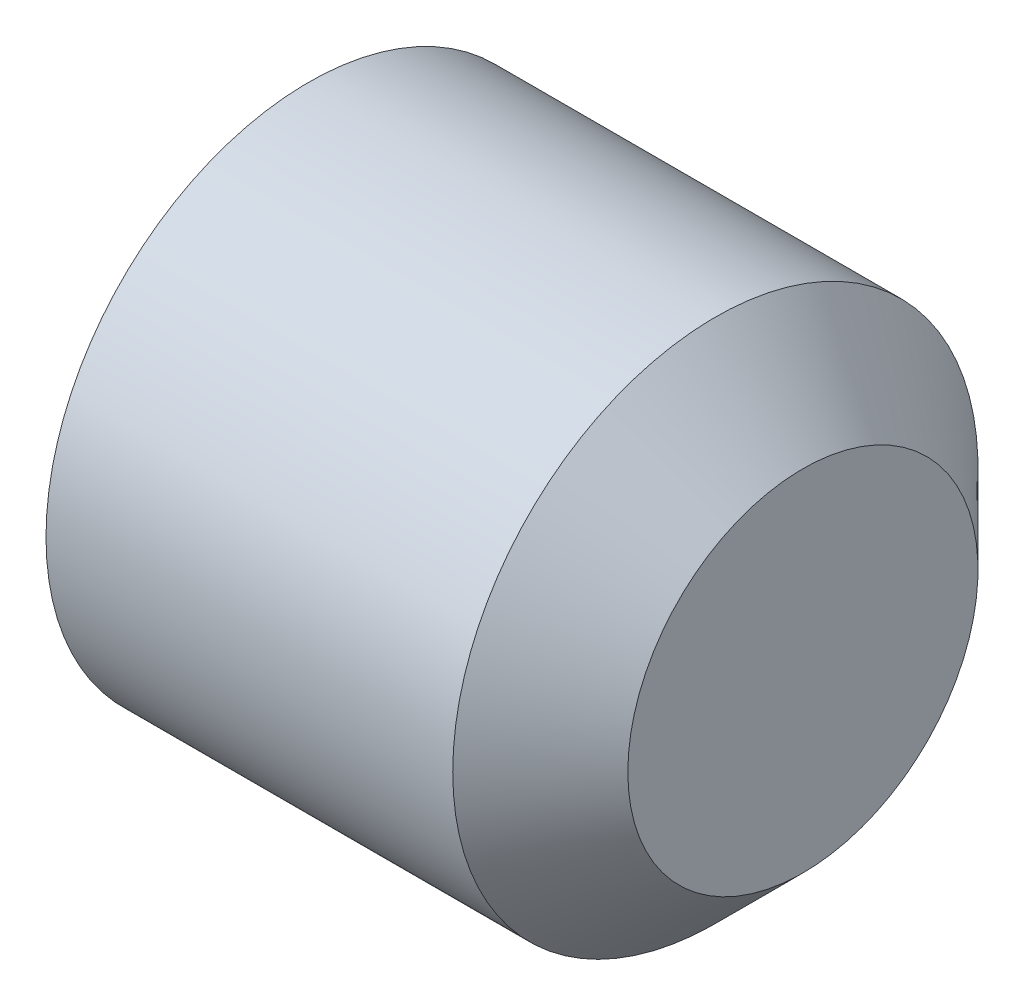
ISO-10303-21;
HEADER;
FILE_DESCRIPTION(('STEP AP214'),'2;1');
FILE_NAME('part.step','',(''),(''),'','','');
FILE_SCHEMA(('AUTOMOTIVE_DESIGN { 1 0 10303 214 1 1 1 1 }'));
ENDSEC;
DATA;
#1=APPLICATION_CONTEXT('core data for automotive mechanical design processes');
#2=APPLICATION_PROTOCOL_DEFINITION('international standard','automotive_design',2000,#1);
#3=PRODUCT_CONTEXT('',#1,'mechanical');
#4=PRODUCT('Part','Part','',(#3));
#5=PRODUCT_RELATED_PRODUCT_CATEGORY('part','',(#4));
#6=PRODUCT_DEFINITION_FORMATION('','',#4);
#7=PRODUCT_DEFINITION_CONTEXT('part definition',#1,'design');
#8=PRODUCT_DEFINITION('design','',#6,#7);
#9=PRODUCT_DEFINITION_SHAPE('','',#8);
#10=(LENGTH_UNIT() NAMED_UNIT(*) SI_UNIT(.MILLI.,.METRE.));
#11=(NAMED_UNIT(*) PLANE_ANGLE_UNIT() SI_UNIT($,.RADIAN.));
#12=(NAMED_UNIT(*) SI_UNIT($,.STERADIAN.) SOLID_ANGLE_UNIT());
#13=UNCERTAINTY_MEASURE_WITH_UNIT(LENGTH_MEASURE(1.E-05),#10,'distance_accuracy_value','');
#14=(GEOMETRIC_REPRESENTATION_CONTEXT(3) GLOBAL_UNCERTAINTY_ASSIGNED_CONTEXT((#13)) GLOBAL_UNIT_ASSIGNED_CONTEXT((#10,
#11,#12)) REPRESENTATION_CONTEXT('',''));
#15=CARTESIAN_POINT('',(0.,0.,0.));
#16=DIRECTION('',(0.,0.,1.));
#17=DIRECTION('',(1.,0.,0.));
#18=AXIS2_PLACEMENT_3D('',#15,#16,#17);
#19=CARTESIAN_POINT('',(0.5,0.,0.));
#20=DIRECTION('',(-1.,0.,0.));
#21=DIRECTION('',(0.,0.,1.));
#22=AXIS2_PLACEMENT_3D('',#19,#20,#21);
#23=CONICAL_SURFACE('',#22,0.,1.0471975511966);
#24=CARTESIAN_POINT('',(0.,0.,0.));
#25=DIRECTION('',(-1.,0.,0.));
#26=DIRECTION('',(0.,0.,1.));
#27=AXIS2_PLACEMENT_3D('',#24,#25,#26);
#28=CIRCLE('',#27,0.86602540378444);
#29=CARTESIAN_POINT('',(0.,0.,0.86602540378444));
#30=VERTEX_POINT('',#29);
#31=CARTESIAN_POINT('',(0.,0.75,0.433012701892222));
#32=VERTEX_POINT('',#31);
#33=EDGE_CURVE('E139',#30,#32,#28,.T.);
#34=ORIENTED_EDGE('',*,*,#33,.T.);
#35=CARTESIAN_POINT('',(-6.66799982216073E-05,0.7502,0.432897231838382));
#36=CARTESIAN_POINT('',(0.0109279672545947,0.717238666576005,0.451927466563575));
#37=CARTESIAN_POINT('',(0.0209278588304373,0.68399281869625,0.471121965786389));
#38=CARTESIAN_POINT('',(0.0383842880739241,0.616925218141244,0.509843463020724));
#39=CARTESIAN_POINT('',(0.0458346476710157,0.583102272153654,0.529371149991445));
#40=CARTESIAN_POINT('',(0.0574342962607427,0.515875632570363,0.568184468451572));
#41=CARTESIAN_POINT('',(0.0616607517951379,0.482482293499614,0.58746412175321));
#42=CARTESIAN_POINT('',(0.0667098540533308,0.415538173911306,0.626114327218181));
#43=CARTESIAN_POINT('',(0.0675366780658327,0.381987637355587,0.645484738530082));
#44=CARTESIAN_POINT('',(0.065833231960248,0.319275698978883,0.681691493033276));
#45=CARTESIAN_POINT('',(0.0637212206264606,0.290104995811374,0.698533206359488));
#46=CARTESIAN_POINT('',(0.0570222121958373,0.231953671848458,0.732106888903211));
#47=CARTESIAN_POINT('',(0.0524329180465317,0.202973252776875,0.748838741655417));
#48=CARTESIAN_POINT('',(0.0409580031195663,0.144701650655193,0.782481866826481));
#49=CARTESIAN_POINT('',(0.0340236523302113,0.115417857581381,0.79938887264054));
#50=CARTESIAN_POINT('',(0.0182846224056367,0.0572874895838318,0.832950456252017));
#51=CARTESIAN_POINT('',(0.00948365081374561,0.0284401676519286,0.849605465334801));
#52=CARTESIAN_POINT('',(-6.66799982221558E-05,-0.000199999999999971,0.866140873838278));
#53=B_SPLINE_CURVE_WITH_KNOTS('',3,(#35,#36,#37,#38,#39,#40,#41,#42,#43,#44,#45,#46,#47,#48,#49,
#50,#51,#52),.UNSPECIFIED.,.F.,.F.,(4,2,2,2,2,2,2,2,4),(0.,0.118896819359341,0.238079744533805,
0.354311719456401,0.470400831872516,0.571553114284106,0.672799351342655,0.776293900714049,
0.87958477934405),.UNSPECIFIED.);
#54=EDGE_CURVE('E11',#32,#30,#53,.T.);
#55=ORIENTED_EDGE('',*,*,#54,.T.);
#56=EDGE_LOOP('',(#34,#55));
#57=FACE_BOUND('',#56,.T.);
#58=ADVANCED_FACE('F40',(#57),#23,.F.);
#59=CARTESIAN_POINT('',(0.,-0.75,0.43301270189222));
#60=VERTEX_POINT('',#59);
#61=EDGE_CURVE('E138',#60,#30,#28,.T.);
#62=ORIENTED_EDGE('',*,*,#61,.T.);
#63=CARTESIAN_POINT('',(-6.66799982221782E-05,0.000200000000000024,0.866140873838278));
#64=CARTESIAN_POINT('',(0.0109279672545941,-0.0327613334239957,0.847110639113085));
#65=CARTESIAN_POINT('',(0.0209278588304367,-0.0660071813037502,0.827916139890271));
#66=CARTESIAN_POINT('',(0.0383842880739237,-0.133074781858756,0.789194642655936));
#67=CARTESIAN_POINT('',(0.0458346476710154,-0.166897727846346,0.769666955685215));
#68=CARTESIAN_POINT('',(0.0574342962607425,-0.234124367429637,0.730853637225088));
#69=CARTESIAN_POINT('',(0.0616607517951377,-0.267517706500387,0.711573983923451));
#70=CARTESIAN_POINT('',(0.0667098540533307,-0.334461826088694,0.672923778458478));
#71=CARTESIAN_POINT('',(0.0675366780658326,-0.368012362644413,0.653553367146578));
#72=CARTESIAN_POINT('',(0.065833231960248,-0.430724301021117,0.617346612643384));
#73=CARTESIAN_POINT('',(0.0637212206264607,-0.459895004188626,0.600504899317172));
#74=CARTESIAN_POINT('',(0.0570222121958375,-0.518046328151543,0.566931216773449));
#75=CARTESIAN_POINT('',(0.052432918046532,-0.547026747223126,0.550199364021243));
#76=CARTESIAN_POINT('',(0.0409580031195668,-0.605298349344807,0.516556238850179));
#77=CARTESIAN_POINT('',(0.0340236523302118,-0.63458214241862,0.49964923303612));
#78=CARTESIAN_POINT('',(0.0182846224056372,-0.692712510416168,0.466087649424643));
#79=CARTESIAN_POINT('',(0.00948365081374614,-0.721559832348072,0.449432640341859));
#80=CARTESIAN_POINT('',(-6.6679998221607E-05,-0.7502,0.432897231838382));
#81=B_SPLINE_CURVE_WITH_KNOTS('',3,(#63,#64,#65,#66,#67,#68,#69,#70,#71,#72,#73,#74,#75,#76,#77,
#78,#79,#80),.UNSPECIFIED.,.F.,.F.,(4,2,2,2,2,2,2,2,4),(0.,0.118896819359341,0.238079744533806,
0.354311719456402,0.470400831872516,0.571553114284106,0.672799351342656,0.776293900714049,
0.87958477934405),.UNSPECIFIED.);
#82=EDGE_CURVE('E54',#30,#60,#81,.T.);
#83=ORIENTED_EDGE('',*,*,#82,.T.);
#84=EDGE_LOOP('',(#62,#83));
#85=FACE_BOUND('',#84,.T.);
#86=ADVANCED_FACE('F214',(#85),#23,.F.);
#87=CARTESIAN_POINT('',(0.,-0.75,-0.43301270189222));
#88=VERTEX_POINT('',#87);
#89=EDGE_CURVE('E242',#88,#60,#28,.T.);
#90=ORIENTED_EDGE('',*,*,#89,.T.);
#91=CARTESIAN_POINT('',(-0.433916243365394,-0.75,1.43321270189222));
#92=CARTESIAN_POINT('',(-0.399618568158197,-0.75,1.36606683502777));
#93=CARTESIAN_POINT('',(-0.365651862584069,-0.75,1.29873887092999));
#94=CARTESIAN_POINT('',(-0.298877307857266,-0.75,1.16336842342566));
#95=CARTESIAN_POINT('',(-0.266071556455107,-0.75,1.09532490870407));
#96=CARTESIAN_POINT('',(-0.200612521876176,-0.75,0.954916510940638));
#97=CARTESIAN_POINT('',(-0.16805207687524,-0.75,0.882508020823048));
#98=CARTESIAN_POINT('',(-0.106139543575523,-0.75,0.736347383880538));
#99=CARTESIAN_POINT('',(-0.0767853575530622,-0.75,0.662596152860419));
#100=CARTESIAN_POINT('',(-0.0344925144918121,-0.75,0.543812755889771));
#101=CARTESIAN_POINT('',(-0.0197633393337374,-0.75,0.499425775516502));
#102=CARTESIAN_POINT('',(0.00704230453915017,-0.75,0.409866081146042));
#103=CARTESIAN_POINT('',(0.0191201726602635,-0.75,0.364693795301044));
#104=CARTESIAN_POINT('',(0.0395325170413964,-0.75,0.274372006403573));
#105=CARTESIAN_POINT('',(0.047932519639834,-0.75,0.229237746527779));
#106=CARTESIAN_POINT('',(0.0604133198374797,-0.75,0.138378132265814));
#107=CARTESIAN_POINT('',(0.0644965476474826,-0.75,0.0926531251449315));
#108=CARTESIAN_POINT('',(0.0678102435593724,-0.75,0.000484998044596922));
#109=CARTESIAN_POINT('',(0.066983601436463,-0.75,-0.0459602805353406));
#110=CARTESIAN_POINT('',(0.0604665934580115,-0.75,-0.138510564072106));
#111=CARTESIAN_POINT('',(0.0547743068507406,-0.75,-0.18461542739672));
#112=CARTESIAN_POINT('',(0.039119149449605,-0.75,-0.276999368453847));
#113=CARTESIAN_POINT('',(0.0290746306437487,-0.75,-0.323264096111191));
#114=CARTESIAN_POINT('',(0.00570473952587702,-0.75,-0.414944949279294));
#115=CARTESIAN_POINT('',(-0.00762138849560119,-0.75,-0.460360876727503));
#116=CARTESIAN_POINT('',(-0.0355013539306271,-0.75,-0.54677574574007));
#117=CARTESIAN_POINT('',(-0.0498696976528041,-0.75,-0.587835684825918));
#118=CARTESIAN_POINT('',(-0.0801207602083334,-0.75,-0.669397508788868));
#119=CARTESIAN_POINT('',(-0.0960037784843394,-0.75,-0.709899281500738));
#120=CARTESIAN_POINT('',(-0.145349092225707,-0.75,-0.830787683189045));
#121=CARTESIAN_POINT('',(-0.180483491990364,-0.75,-0.910487402329192));
#122=CARTESIAN_POINT('',(-0.251355043505842,-0.75,-1.06447961866958));
#123=CARTESIAN_POINT('',(-0.286960570037413,-0.75,-1.13883412573839));
#124=CARTESIAN_POINT('',(-0.341413352748403,-0.75,-1.24972062027204));
#125=CARTESIAN_POINT('',(-0.35971150389094,-0.75,-1.28652316950015));
#126=CARTESIAN_POINT('',(-0.396605902450401,-0.75,-1.35997498768799));
#127=CARTESIAN_POINT('',(-0.415202126066091,-0.75,-1.39662426859449));
#128=CARTESIAN_POINT('',(-0.433916243365394,-0.75,-1.43321270189222));
#129=B_SPLINE_CURVE_WITH_KNOTS('',3,(#91,#92,#93,#94,#95,#96,#97,#98,#99,#100,#101,#102,#103,
#104,#105,#106,#107,#108,#109,#110,#111,#112,#113,#114,#115,#116,#117,#118,#119,#120,#121,#122,
#123,#124,#125,#126,#127,#128),.UNSPECIFIED.,.F.,.F.,(4,2,2,2,2,2,2,2,2,2,2,2,2,2,2,2,2,2,4),
(0.,0.226212170495582,0.452814140544187,0.690955605221207,0.92894031846288,1.06918355725571,
1.20935259427054,1.34691118026573,1.4843922837227,1.62347563632315,1.76261391854908,
1.90448382535697,2.04638643345541,2.17685299489812,2.30734540252851,2.56855197443952,
2.8158551359845,2.9391552371937,3.06244554139839),.UNSPECIFIED.);
#130=EDGE_CURVE('E188',#60,#88,#129,.T.);
#131=ORIENTED_EDGE('',*,*,#130,.T.);
#132=EDGE_LOOP('',(#90,#131));
#133=FACE_BOUND('',#132,.T.);
#134=ADVANCED_FACE('F220',(#133),#23,.F.);
#135=CARTESIAN_POINT('',(0.,0.,-0.86602540378444));
#136=VERTEX_POINT('',#135);
#137=EDGE_CURVE('E240',#136,#88,#28,.T.);
#138=ORIENTED_EDGE('',*,*,#137,.T.);
#139=CARTESIAN_POINT('',(-6.66799982216073E-05,-0.7502,-0.432897231838382));
#140=CARTESIAN_POINT('',(0.0109279672545947,-0.717238666576005,-0.451927466563575));
#141=CARTESIAN_POINT('',(0.0209278588304373,-0.68399281869625,-0.471121965786389));
#142=CARTESIAN_POINT('',(0.0383842880739241,-0.616925218141244,-0.509843463020724));
#143=CARTESIAN_POINT('',(0.0458346476710157,-0.583102272153654,-0.529371149991445));
#144=CARTESIAN_POINT('',(0.0574342962607427,-0.515875632570363,-0.568184468451572));
#145=CARTESIAN_POINT('',(0.0616607517951379,-0.482482293499614,-0.58746412175321));
#146=CARTESIAN_POINT('',(0.0667098540533308,-0.415538173911306,-0.626114327218181));
#147=CARTESIAN_POINT('',(0.0675366780658327,-0.381987637355587,-0.645484738530082));
#148=CARTESIAN_POINT('',(0.065833231960248,-0.319275698978883,-0.681691493033276));
#149=CARTESIAN_POINT('',(0.0637212206264606,-0.290104995811374,-0.698533206359488));
#150=CARTESIAN_POINT('',(0.0570222121958373,-0.231953671848458,-0.732106888903211));
#151=CARTESIAN_POINT('',(0.0524329180465317,-0.202973252776875,-0.748838741655417));
#152=CARTESIAN_POINT('',(0.0409580031195663,-0.144701650655193,-0.782481866826481));
#153=CARTESIAN_POINT('',(0.0340236523302113,-0.115417857581381,-0.79938887264054));
#154=CARTESIAN_POINT('',(0.0182846224056367,-0.0572874895838318,-0.832950456252017));
#155=CARTESIAN_POINT('',(0.00948365081374561,-0.0284401676519286,-0.849605465334801));
#156=CARTESIAN_POINT('',(-6.66799982221558E-05,0.000199999999999971,-0.866140873838278));
#157=B_SPLINE_CURVE_WITH_KNOTS('',3,(#139,#140,#141,#142,#143,#144,#145,#146,#147,#148,#149,
#150,#151,#152,#153,#154,#155,#156),.UNSPECIFIED.,.F.,.F.,(4,2,2,2,2,2,2,2,4),(0.,
0.118896819359341,0.238079744533805,0.354311719456401,0.470400831872516,0.571553114284106,
0.672799351342655,0.776293900714049,0.87958477934405),.UNSPECIFIED.);
#158=EDGE_CURVE('E182',#88,#136,#157,.T.);
#159=ORIENTED_EDGE('',*,*,#158,.T.);
#160=EDGE_LOOP('',(#138,#159));
#161=FACE_BOUND('',#160,.T.);
#162=ADVANCED_FACE('F231',(#161),#23,.F.);
#163=CARTESIAN_POINT('',(0.,0.75,-0.43301270189222));
#164=VERTEX_POINT('',#163);
#165=EDGE_CURVE('E238',#164,#136,#28,.T.);
#166=ORIENTED_EDGE('',*,*,#165,.T.);
#167=CARTESIAN_POINT('',(-6.66799982221782E-05,-0.000200000000000024,-0.866140873838278));
#168=CARTESIAN_POINT('',(0.0109279672545941,0.0327613334239957,-0.847110639113085));
#169=CARTESIAN_POINT('',(0.0209278588304367,0.0660071813037502,-0.827916139890271));
#170=CARTESIAN_POINT('',(0.0383842880739237,0.133074781858756,-0.789194642655936));
#171=CARTESIAN_POINT('',(0.0458346476710154,0.166897727846346,-0.769666955685215));
#172=CARTESIAN_POINT('',(0.0574342962607425,0.234124367429637,-0.730853637225088));
#173=CARTESIAN_POINT('',(0.0616607517951377,0.267517706500387,-0.711573983923451));
#174=CARTESIAN_POINT('',(0.0667098540533307,0.334461826088694,-0.672923778458478));
#175=CARTESIAN_POINT('',(0.0675366780658326,0.368012362644413,-0.653553367146578));
#176=CARTESIAN_POINT('',(0.065833231960248,0.430724301021117,-0.617346612643384));
#177=CARTESIAN_POINT('',(0.0637212206264607,0.459895004188626,-0.600504899317172));
#178=CARTESIAN_POINT('',(0.0570222121958375,0.518046328151543,-0.566931216773449));
#179=CARTESIAN_POINT('',(0.052432918046532,0.547026747223126,-0.550199364021243));
#180=CARTESIAN_POINT('',(0.0409580031195668,0.605298349344807,-0.516556238850179));
#181=CARTESIAN_POINT('',(0.0340236523302118,0.63458214241862,-0.49964923303612));
#182=CARTESIAN_POINT('',(0.0182846224056372,0.692712510416168,-0.466087649424643));
#183=CARTESIAN_POINT('',(0.00948365081374614,0.721559832348072,-0.449432640341859));
#184=CARTESIAN_POINT('',(-6.6679998221607E-05,0.7502,-0.432897231838382));
#185=B_SPLINE_CURVE_WITH_KNOTS('',3,(#167,#168,#169,#170,#171,#172,#173,#174,#175,#176,#177,
#178,#179,#180,#181,#182,#183,#184),.UNSPECIFIED.,.F.,.F.,(4,2,2,2,2,2,2,2,4),(0.,
0.118896819359341,0.238079744533806,0.354311719456402,0.470400831872516,0.571553114284106,
0.672799351342656,0.776293900714049,0.87958477934405),.UNSPECIFIED.);
#186=EDGE_CURVE('E121',#136,#164,#185,.T.);
#187=ORIENTED_EDGE('',*,*,#186,.T.);
#188=EDGE_LOOP('',(#166,#187));
#189=FACE_BOUND('',#188,.T.);
#190=ADVANCED_FACE('F223',(#189),#23,.F.);
#191=EDGE_CURVE('E143',#32,#164,#28,.T.);
#192=ORIENTED_EDGE('',*,*,#191,.T.);
#193=CARTESIAN_POINT('',(-0.433916243365394,0.75,-1.43321270189222));
#194=CARTESIAN_POINT('',(-0.399618568158197,0.75,-1.36606683502777));
#195=CARTESIAN_POINT('',(-0.365651862584069,0.75,-1.29873887092999));
#196=CARTESIAN_POINT('',(-0.298877307857266,0.75,-1.16336842342566));
#197=CARTESIAN_POINT('',(-0.266071556455107,0.75,-1.09532490870407));
#198=CARTESIAN_POINT('',(-0.200612521876176,0.75,-0.954916510940638));
#199=CARTESIAN_POINT('',(-0.16805207687524,0.75,-0.882508020823048));
#200=CARTESIAN_POINT('',(-0.106139543575523,0.75,-0.736347383880538));
#201=CARTESIAN_POINT('',(-0.0767853575530622,0.75,-0.662596152860419));
#202=CARTESIAN_POINT('',(-0.0344925144918121,0.75,-0.543812755889771));
#203=CARTESIAN_POINT('',(-0.0197633393337374,0.75,-0.499425775516502));
#204=CARTESIAN_POINT('',(0.00704230453915017,0.75,-0.409866081146042));
#205=CARTESIAN_POINT('',(0.0191201726602635,0.75,-0.364693795301044));
#206=CARTESIAN_POINT('',(0.0395325170413964,0.75,-0.274372006403573));
#207=CARTESIAN_POINT('',(0.047932519639834,0.75,-0.229237746527779));
#208=CARTESIAN_POINT('',(0.0604133198374797,0.75,-0.138378132265814));
#209=CARTESIAN_POINT('',(0.0644965476474826,0.75,-0.0926531251449315));
#210=CARTESIAN_POINT('',(0.0678102435593724,0.75,-0.000484998044596922));
#211=CARTESIAN_POINT('',(0.066983601436463,0.75,0.0459602805353406));
#212=CARTESIAN_POINT('',(0.0604665934580115,0.75,0.138510564072106));
#213=CARTESIAN_POINT('',(0.0547743068507406,0.75,0.18461542739672));
#214=CARTESIAN_POINT('',(0.039119149449605,0.75,0.276999368453847));
#215=CARTESIAN_POINT('',(0.0290746306437487,0.75,0.323264096111191));
#216=CARTESIAN_POINT('',(0.00570473952587702,0.75,0.414944949279294));
#217=CARTESIAN_POINT('',(-0.00762138849560119,0.75,0.460360876727503));
#218=CARTESIAN_POINT('',(-0.0355013539306271,0.75,0.54677574574007));
#219=CARTESIAN_POINT('',(-0.0498696976528041,0.75,0.587835684825918));
#220=CARTESIAN_POINT('',(-0.0801207602083334,0.75,0.669397508788868));
#221=CARTESIAN_POINT('',(-0.0960037784843394,0.75,0.709899281500738));
#222=CARTESIAN_POINT('',(-0.145349092225707,0.75,0.830787683189045));
#223=CARTESIAN_POINT('',(-0.180483491990364,0.75,0.910487402329192));
#224=CARTESIAN_POINT('',(-0.251355043505842,0.75,1.06447961866958));
#225=CARTESIAN_POINT('',(-0.286960570037413,0.75,1.13883412573839));
#226=CARTESIAN_POINT('',(-0.341413352748403,0.75,1.24972062027204));
#227=CARTESIAN_POINT('',(-0.35971150389094,0.75,1.28652316950015));
#228=CARTESIAN_POINT('',(-0.396605902450401,0.75,1.35997498768799));
#229=CARTESIAN_POINT('',(-0.415202126066091,0.75,1.39662426859449));
#230=CARTESIAN_POINT('',(-0.433916243365394,0.75,1.43321270189222));
#231=B_SPLINE_CURVE_WITH_KNOTS('',3,(#193,#194,#195,#196,#197,#198,#199,#200,#201,#202,#203,
#204,#205,#206,#207,#208,#209,#210,#211,#212,#213,#214,#215,#216,#217,#218,#219,#220,#221,#222,
#223,#224,#225,#226,#227,#228,#229,#230),.UNSPECIFIED.,.F.,.F.,(4,2,2,2,2,2,2,2,2,2,2,2,2,2,2,2,
2,2,4),(0.,0.226212170495582,0.452814140544187,0.690955605221207,0.92894031846288,
1.06918355725571,1.20935259427054,1.34691118026573,1.4843922837227,1.62347563632315,
1.76261391854908,1.90448382535697,2.04638643345541,2.17685299489812,2.30734540252851,
2.56855197443952,2.8158551359845,2.9391552371937,3.06244554139839),.UNSPECIFIED.);
#232=EDGE_CURVE('E87',#164,#32,#231,.T.);
#233=ORIENTED_EDGE('',*,*,#232,.T.);
#234=EDGE_LOOP('',(#192,#233));
#235=FACE_BOUND('',#234,.T.);
#236=ADVANCED_FACE('F216',(#235),#23,.F.);
#237=CARTESIAN_POINT('',(3.,0.,0.));
#238=DIRECTION('',(1.,0.,0.));
#239=DIRECTION('',(0.,0.,-1.));
#240=AXIS2_PLACEMENT_3D('',#237,#238,#239);
#241=PLANE('',#240);
#242=CARTESIAN_POINT('',(3.,0.,0.));
#243=DIRECTION('',(-1.,0.,0.));
#244=DIRECTION('',(0.,0.,1.));
#245=AXIS2_PLACEMENT_3D('',#242,#243,#244);
#246=CIRCLE('',#245,1.);
#247=CARTESIAN_POINT('',(3.,0.,1.));
#248=VERTEX_POINT('',#247);
#249=EDGE_CURVE('E152',#248,#248,#246,.T.);
#250=ORIENTED_EDGE('',*,*,#249,.F.);
#251=EDGE_LOOP('',(#250));
#252=FACE_BOUND('',#251,.T.);
#253=ADVANCED_FACE('F42',(#252),#241,.T.);
#254=CARTESIAN_POINT('',(2.5,0.,0.));
#255=DIRECTION('',(-1.,0.,0.));
#256=DIRECTION('',(0.,0.,1.));
#257=AXIS2_PLACEMENT_3D('',#254,#255,#256);
#258=CONICAL_SURFACE('',#257,1.5,0.785398163397448);
#259=ORIENTED_EDGE('',*,*,#249,.T.);
#260=EDGE_LOOP('',(#259));
#261=FACE_BOUND('',#260,.T.);
#262=CARTESIAN_POINT('',(2.5,0.,0.));
#263=DIRECTION('',(-1.,0.,0.));
#264=DIRECTION('',(0.,0.,1.));
#265=AXIS2_PLACEMENT_3D('',#262,#263,#264);
#266=CIRCLE('',#265,1.5);
#267=CARTESIAN_POINT('',(2.5,0.,1.5));
#268=VERTEX_POINT('',#267);
#269=EDGE_CURVE('E149',#268,#268,#266,.T.);
#270=ORIENTED_EDGE('',*,*,#269,.F.);
#271=EDGE_LOOP('',(#270));
#272=FACE_BOUND('',#271,.T.);
#273=ADVANCED_FACE('F229',(#261,#272),#258,.T.);
#274=CARTESIAN_POINT('',(0.5,0.,0.));
#275=DIRECTION('',(-1.,0.,0.));
#276=DIRECTION('',(0.,0.,1.));
#277=AXIS2_PLACEMENT_3D('',#274,#275,#276);
#278=CYLINDRICAL_SURFACE('',#277,1.5);
#279=ORIENTED_EDGE('',*,*,#269,.T.);
#280=EDGE_LOOP('',(#279));
#281=FACE_BOUND('',#280,.T.);
#282=CARTESIAN_POINT('',(0.17695785750662,0.,0.));
#283=DIRECTION('',(-1.,0.,0.));
#284=DIRECTION('',(0.,0.,1.));
#285=AXIS2_PLACEMENT_3D('',#282,#283,#284);
#286=CIRCLE('',#285,1.5);
#287=CARTESIAN_POINT('',(0.17695785750662,0.,1.5));
#288=VERTEX_POINT('',#287);
#289=EDGE_CURVE('E146',#288,#288,#286,.T.);
#290=ORIENTED_EDGE('',*,*,#289,.F.);
#291=EDGE_LOOP('',(#290));
#292=FACE_BOUND('',#291,.T.);
#293=ADVANCED_FACE('F280',(#281,#292),#278,.T.);
#294=CARTESIAN_POINT('',(0.,0.,0.));
#295=DIRECTION('',(1.,0.,0.));
#296=DIRECTION('',(0.,0.,-1.));
#297=AXIS2_PLACEMENT_3D('',#294,#295,#296);
#298=CONICAL_SURFACE('',#297,1.1935,1.0471975511966);
#299=ORIENTED_EDGE('',*,*,#289,.T.);
#300=EDGE_LOOP('',(#299));
#301=FACE_BOUND('',#300,.T.);
#302=CARTESIAN_POINT('',(0.,0.,0.));
#303=DIRECTION('',(-1.,0.,0.));
#304=DIRECTION('',(0.,0.,1.));
#305=AXIS2_PLACEMENT_3D('',#302,#303,#304);
#306=CIRCLE('',#305,1.1935);
#307=CARTESIAN_POINT('',(0.,0.,1.1935));
#308=VERTEX_POINT('',#307);
#309=EDGE_CURVE('E142',#308,#308,#306,.T.);
#310=ORIENTED_EDGE('',*,*,#309,.F.);
#311=EDGE_LOOP('',(#310));
#312=FACE_BOUND('',#311,.T.);
#313=ADVANCED_FACE('F211',(#301,#312),#298,.T.);
#314=CARTESIAN_POINT('',(0.,-1.1935,0.));
#315=DIRECTION('',(-1.,0.,0.));
#316=DIRECTION('',(0.,0.,1.));
#317=AXIS2_PLACEMENT_3D('',#314,#315,#316);
#318=PLANE('',#317);
#319=ORIENTED_EDGE('',*,*,#309,.T.);
#320=EDGE_LOOP('',(#319));
#321=FACE_BOUND('',#320,.T.);
#322=ORIENTED_EDGE('',*,*,#33,.F.);
#323=ORIENTED_EDGE('',*,*,#61,.F.);
#324=ORIENTED_EDGE('',*,*,#89,.F.);
#325=ORIENTED_EDGE('',*,*,#137,.F.);
#326=ORIENTED_EDGE('',*,*,#165,.F.);
#327=ORIENTED_EDGE('',*,*,#191,.F.);
#328=EDGE_LOOP('',(#322,#323,#324,#325,#326,#327));
#329=FACE_BOUND('',#328,.T.);
#330=ADVANCED_FACE('F206',(#321,#329),#318,.T.);
#331=CARTESIAN_POINT('',(1.2,0.75,0.43301270189222));
#332=DIRECTION('',(0.,-0.500000000000001,-0.866025403784438));
#333=DIRECTION('',(0.,0.866025403784438,-0.500000000000001));
#334=AXIS2_PLACEMENT_3D('',#331,#332,#333);
#335=PLANE('',#334);
#336=DIRECTION('',(-1.,0.,0.));
#337=VECTOR('',#336,1.);
#338=CARTESIAN_POINT('',(1.2,0.75,0.43301270189222));
#339=LINE('',#338,#337);
#340=CARTESIAN_POINT('',(1.2,0.75,0.43301270189222));
#341=VERTEX_POINT('',#340);
#342=EDGE_CURVE('E61',#341,#32,#339,.T.);
#343=ORIENTED_EDGE('',*,*,#342,.F.);
#344=DIRECTION('',(0.,-0.866025403784438,0.500000000000001));
#345=VECTOR('',#344,1.);
#346=CARTESIAN_POINT('',(1.2,0.75,0.43301270189222));
#347=LINE('',#346,#345);
#348=CARTESIAN_POINT('',(1.2,0.,0.86602540378444));
#349=VERTEX_POINT('',#348);
#350=EDGE_CURVE('E251',#341,#349,#347,.T.);
#351=ORIENTED_EDGE('',*,*,#350,.T.);
#352=DIRECTION('',(-1.,0.,0.));
#353=VECTOR('',#352,1.);
#354=CARTESIAN_POINT('',(1.2,0.,0.86602540378444));
#355=LINE('',#354,#353);
#356=EDGE_CURVE('E135',#349,#30,#355,.T.);
#357=ORIENTED_EDGE('',*,*,#356,.T.);
#358=ORIENTED_EDGE('',*,*,#54,.F.);
#359=EDGE_LOOP('',(#343,#351,#357,#358));
#360=FACE_BOUND('',#359,.T.);
#361=ADVANCED_FACE('F202',(#360),#335,.T.);
#362=CARTESIAN_POINT('',(1.2,0.,0.86602540378444));
#363=DIRECTION('',(0.,0.500000000000001,-0.866025403784438));
#364=DIRECTION('',(0.,0.866025403784438,0.500000000000001));
#365=AXIS2_PLACEMENT_3D('',#362,#363,#364);
#366=PLANE('',#365);
#367=ORIENTED_EDGE('',*,*,#356,.F.);
#368=DIRECTION('',(0.,-0.866025403784438,-0.500000000000001));
#369=VECTOR('',#368,1.);
#370=CARTESIAN_POINT('',(1.2,0.,0.86602540378444));
#371=LINE('',#370,#369);
#372=CARTESIAN_POINT('',(1.2,-0.75,0.43301270189222));
#373=VERTEX_POINT('',#372);
#374=EDGE_CURVE('E96',#349,#373,#371,.T.);
#375=ORIENTED_EDGE('',*,*,#374,.T.);
#376=DIRECTION('',(-1.,0.,0.));
#377=VECTOR('',#376,1.);
#378=CARTESIAN_POINT('',(1.2,-0.75,0.43301270189222));
#379=LINE('',#378,#377);
#380=EDGE_CURVE('E132',#373,#60,#379,.T.);
#381=ORIENTED_EDGE('',*,*,#380,.T.);
#382=ORIENTED_EDGE('',*,*,#82,.F.);
#383=EDGE_LOOP('',(#367,#375,#381,#382));
#384=FACE_BOUND('',#383,.T.);
#385=ADVANCED_FACE('F199',(#384),#366,.T.);
#386=CARTESIAN_POINT('',(1.2,-0.75,0.43301270189222));
#387=DIRECTION('',(0.,1.,0.));
#388=DIRECTION('',(0.,0.,1.));
#389=AXIS2_PLACEMENT_3D('',#386,#387,#388);
#390=PLANE('',#389);
#391=ORIENTED_EDGE('',*,*,#380,.F.);
#392=DIRECTION('',(0.,0.,-1.));
#393=VECTOR('',#392,1.);
#394=CARTESIAN_POINT('',(1.2,-0.75,0.43301270189222));
#395=LINE('',#394,#393);
#396=CARTESIAN_POINT('',(1.2,-0.75,-0.43301270189222));
#397=VERTEX_POINT('',#396);
#398=EDGE_CURVE('E116',#373,#397,#395,.T.);
#399=ORIENTED_EDGE('',*,*,#398,.T.);
#400=DIRECTION('',(-1.,0.,0.));
#401=VECTOR('',#400,1.);
#402=CARTESIAN_POINT('',(1.2,-0.75,-0.43301270189222));
#403=LINE('',#402,#401);
#404=EDGE_CURVE('E113',#397,#88,#403,.T.);
#405=ORIENTED_EDGE('',*,*,#404,.T.);
#406=ORIENTED_EDGE('',*,*,#130,.F.);
#407=EDGE_LOOP('',(#391,#399,#405,#406));
#408=FACE_BOUND('',#407,.T.);
#409=ADVANCED_FACE('F179',(#408),#390,.T.);
#410=CARTESIAN_POINT('',(1.2,-0.75,-0.43301270189222));
#411=DIRECTION('',(0.,0.500000000000001,0.866025403784438));
#412=DIRECTION('',(0.,-0.866025403784438,0.500000000000001));
#413=AXIS2_PLACEMENT_3D('',#410,#411,#412);
#414=PLANE('',#413);
#415=ORIENTED_EDGE('',*,*,#404,.F.);
#416=DIRECTION('',(0.,0.866025403784438,-0.500000000000001));
#417=VECTOR('',#416,1.);
#418=CARTESIAN_POINT('',(1.2,-0.75,-0.43301270189222));
#419=LINE('',#418,#417);
#420=CARTESIAN_POINT('',(1.2,0.,-0.86602540378444));
#421=VERTEX_POINT('',#420);
#422=EDGE_CURVE('E107',#397,#421,#419,.T.);
#423=ORIENTED_EDGE('',*,*,#422,.T.);
#424=DIRECTION('',(-1.,0.,0.));
#425=VECTOR('',#424,1.);
#426=CARTESIAN_POINT('',(1.2,0.,-0.86602540378444));
#427=LINE('',#426,#425);
#428=EDGE_CURVE('E110',#421,#136,#427,.T.);
#429=ORIENTED_EDGE('',*,*,#428,.T.);
#430=ORIENTED_EDGE('',*,*,#158,.F.);
#431=EDGE_LOOP('',(#415,#423,#429,#430));
#432=FACE_BOUND('',#431,.T.);
#433=ADVANCED_FACE('F109',(#432),#414,.T.);
#434=CARTESIAN_POINT('',(1.2,0.,-0.86602540378444));
#435=DIRECTION('',(0.,-0.500000000000001,0.866025403784438));
#436=DIRECTION('',(0.,-0.866025403784438,-0.500000000000001));
#437=AXIS2_PLACEMENT_3D('',#434,#435,#436);
#438=PLANE('',#437);
#439=ORIENTED_EDGE('',*,*,#428,.F.);
#440=DIRECTION('',(0.,0.866025403784438,0.500000000000001));
#441=VECTOR('',#440,1.);
#442=CARTESIAN_POINT('',(1.2,0.,-0.86602540378444));
#443=LINE('',#442,#441);
#444=CARTESIAN_POINT('',(1.2,0.75,-0.43301270189222));
#445=VERTEX_POINT('',#444);
#446=EDGE_CURVE('E115',#421,#445,#443,.T.);
#447=ORIENTED_EDGE('',*,*,#446,.T.);
#448=DIRECTION('',(-1.,0.,0.));
#449=VECTOR('',#448,1.);
#450=CARTESIAN_POINT('',(1.2,0.75,-0.43301270189222));
#451=LINE('',#450,#449);
#452=EDGE_CURVE('E122',#445,#164,#451,.T.);
#453=ORIENTED_EDGE('',*,*,#452,.T.);
#454=ORIENTED_EDGE('',*,*,#186,.F.);
#455=EDGE_LOOP('',(#439,#447,#453,#454));
#456=FACE_BOUND('',#455,.T.);
#457=ADVANCED_FACE('F119',(#456),#438,.T.);
#458=CARTESIAN_POINT('',(1.2,0.75,-0.43301270189222));
#459=DIRECTION('',(0.,-1.,0.));
#460=DIRECTION('',(0.,0.,-1.));
#461=AXIS2_PLACEMENT_3D('',#458,#459,#460);
#462=PLANE('',#461);
#463=ORIENTED_EDGE('',*,*,#452,.F.);
#464=DIRECTION('',(0.,0.,1.));
#465=VECTOR('',#464,1.);
#466=CARTESIAN_POINT('',(1.2,0.75,-0.43301270189222));
#467=LINE('',#466,#465);
#468=EDGE_CURVE('E67',#445,#341,#467,.T.);
#469=ORIENTED_EDGE('',*,*,#468,.T.);
#470=ORIENTED_EDGE('',*,*,#342,.T.);
#471=ORIENTED_EDGE('',*,*,#232,.F.);
#472=EDGE_LOOP('',(#463,#469,#470,#471));
#473=FACE_BOUND('',#472,.T.);
#474=ADVANCED_FACE('F169',(#473),#462,.T.);
#475=CARTESIAN_POINT('',(1.2,0.,0.));
#476=DIRECTION('',(1.,0.,0.));
#477=DIRECTION('',(0.,0.,-1.));
#478=AXIS2_PLACEMENT_3D('',#475,#476,#477);
#479=PLANE('',#478);
#480=ORIENTED_EDGE('',*,*,#350,.F.);
#481=ORIENTED_EDGE('',*,*,#468,.F.);
#482=ORIENTED_EDGE('',*,*,#446,.F.);
#483=ORIENTED_EDGE('',*,*,#422,.F.);
#484=ORIENTED_EDGE('',*,*,#398,.F.);
#485=ORIENTED_EDGE('',*,*,#374,.F.);
#486=EDGE_LOOP('',(#480,#481,#482,#483,#484,#485));
#487=FACE_BOUND('',#486,.T.);
#488=ADVANCED_FACE('F124',(#487),#479,.F.);
#489=CLOSED_SHELL('',(#58,#86,#134,#162,#190,#236,#253,#273,#293,#313,#330,#361,#385,#409,#433,
#457,#474,#488));
#490=MANIFOLD_SOLID_BREP('B2',#489);
#491=ADVANCED_BREP_SHAPE_REPRESENTATION('',(#18,#490),#14);
#492=SHAPE_DEFINITION_REPRESENTATION(#9,#491);
ENDSEC;
END-ISO-10303-21;
